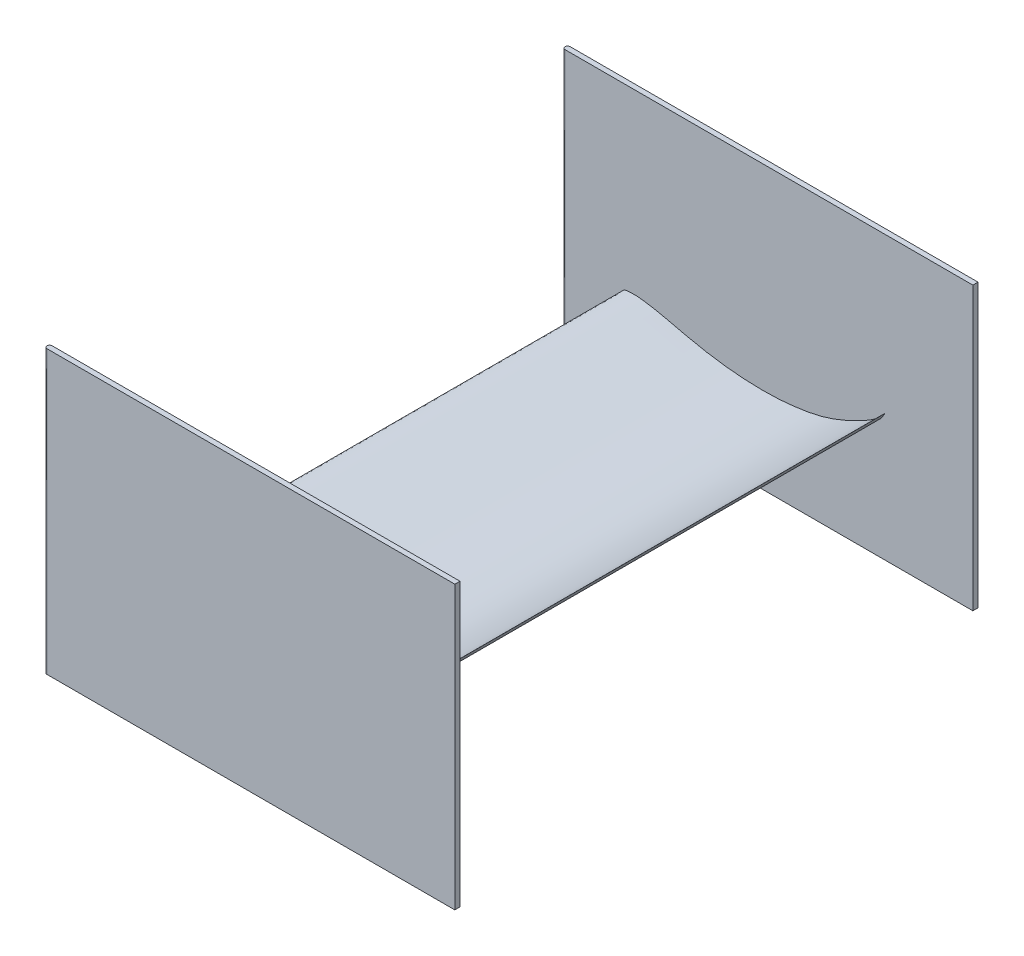
ISO-10303-21;
HEADER;
FILE_DESCRIPTION(('STEP AP214'),'2;1');
FILE_NAME('part.step','',(''),(''),'','','');
FILE_SCHEMA(('AUTOMOTIVE_DESIGN { 1 0 10303 214 1 1 1 1 }'));
ENDSEC;
DATA;
#1=APPLICATION_CONTEXT('core data for automotive mechanical design processes');
#2=APPLICATION_PROTOCOL_DEFINITION('international standard','automotive_design',2000,#1);
#3=PRODUCT_CONTEXT('',#1,'mechanical');
#4=PRODUCT('Part','Part','',(#3));
#5=PRODUCT_RELATED_PRODUCT_CATEGORY('part','',(#4));
#6=PRODUCT_DEFINITION_FORMATION('','',#4);
#7=PRODUCT_DEFINITION_CONTEXT('part definition',#1,'design');
#8=PRODUCT_DEFINITION('design','',#6,#7);
#9=PRODUCT_DEFINITION_SHAPE('','',#8);
#10=(LENGTH_UNIT() NAMED_UNIT(*) SI_UNIT(.MILLI.,.METRE.));
#11=(NAMED_UNIT(*) PLANE_ANGLE_UNIT() SI_UNIT($,.RADIAN.));
#12=(NAMED_UNIT(*) SI_UNIT($,.STERADIAN.) SOLID_ANGLE_UNIT());
#13=UNCERTAINTY_MEASURE_WITH_UNIT(LENGTH_MEASURE(1.E-05),#10,'distance_accuracy_value','');
#14=(GEOMETRIC_REPRESENTATION_CONTEXT(3) GLOBAL_UNCERTAINTY_ASSIGNED_CONTEXT((#13)) GLOBAL_UNIT_ASSIGNED_CONTEXT((#10,
#11,#12)) REPRESENTATION_CONTEXT('',''));
#15=CARTESIAN_POINT('',(0.,0.,0.));
#16=DIRECTION('',(0.,0.,1.));
#17=DIRECTION('',(1.,0.,0.));
#18=AXIS2_PLACEMENT_3D('',#15,#16,#17);
#19=CARTESIAN_POINT('',(-125.,346.245296694016,1005.));
#20=DIRECTION('',(0.,-1.,0.));
#21=DIRECTION('',(1.,0.,0.));
#22=AXIS2_PLACEMENT_3D('',#19,#20,#21);
#23=CYLINDRICAL_SURFACE('',#22,4.99999999999995);
#24=DIRECTION('',(0.,1.,0.));
#25=VECTOR('',#24,1.);
#26=CARTESIAN_POINT('',(-125.,346.245296694016,1010.));
#27=LINE('',#26,#25);
#28=CARTESIAN_POINT('',(-125.,346.245296694016,1010.));
#29=VERTEX_POINT('',#28);
#30=CARTESIAN_POINT('',(-125.,-203.754703305984,1010.));
#31=VERTEX_POINT('',#30);
#32=EDGE_CURVE('E197',#29,#31,#27,.F.);
#33=ORIENTED_EDGE('',*,*,#32,.F.);
#34=CARTESIAN_POINT('',(-125.,346.245296694016,1005.));
#35=DIRECTION('',(0.,-1.,0.));
#36=DIRECTION('',(1.,0.,0.));
#37=AXIS2_PLACEMENT_3D('',#34,#35,#36);
#38=CIRCLE('',#37,4.99999999999995);
#39=CARTESIAN_POINT('',(-125.,346.245296694016,1000.));
#40=VERTEX_POINT('',#39);
#41=EDGE_CURVE('E43',#40,#29,#38,.F.);
#42=ORIENTED_EDGE('',*,*,#41,.F.);
#43=DIRECTION('',(0.,-1.,0.));
#44=VECTOR('',#43,1.);
#45=CARTESIAN_POINT('',(-125.,0.,1000.));
#46=LINE('',#45,#44);
#47=CARTESIAN_POINT('',(-125.,-203.754703305984,1000.));
#48=VERTEX_POINT('',#47);
#49=EDGE_CURVE('E200',#48,#40,#46,.F.);
#50=ORIENTED_EDGE('',*,*,#49,.F.);
#51=CARTESIAN_POINT('',(-125.,-203.754703305984,1005.));
#52=DIRECTION('',(0.,1.,0.));
#53=DIRECTION('',(-1.,0.,0.));
#54=AXIS2_PLACEMENT_3D('',#51,#52,#53);
#55=CIRCLE('',#54,4.99999999999995);
#56=EDGE_CURVE('E11',#31,#48,#55,.F.);
#57=ORIENTED_EDGE('',*,*,#56,.F.);
#58=EDGE_LOOP('',(#33,#42,#50,#57));
#59=FACE_BOUND('',#58,.T.);
#60=ADVANCED_FACE('F35',(#59),#23,.T.);
#61=CARTESIAN_POINT('',(-125.,-203.754703305984,-5.));
#62=DIRECTION('',(0.,1.,0.));
#63=DIRECTION('',(-1.,0.,0.));
#64=AXIS2_PLACEMENT_3D('',#61,#62,#63);
#65=CYLINDRICAL_SURFACE('',#64,5.);
#66=DIRECTION('',(0.,-1.,0.));
#67=VECTOR('',#66,1.);
#68=CARTESIAN_POINT('',(-125.,-203.754703305984,-10.));
#69=LINE('',#68,#67);
#70=CARTESIAN_POINT('',(-125.,-203.754703305984,-10.));
#71=VERTEX_POINT('',#70);
#72=CARTESIAN_POINT('',(-125.,346.245296694016,-10.));
#73=VERTEX_POINT('',#72);
#74=EDGE_CURVE('E104',#71,#73,#69,.F.);
#75=ORIENTED_EDGE('',*,*,#74,.F.);
#76=CARTESIAN_POINT('',(-125.,-203.754703305984,-5.));
#77=DIRECTION('',(0.,1.,0.));
#78=DIRECTION('',(-1.,0.,0.));
#79=AXIS2_PLACEMENT_3D('',#76,#77,#78);
#80=CIRCLE('',#79,5.);
#81=CARTESIAN_POINT('',(-125.,-203.754703305984,0.));
#82=VERTEX_POINT('',#81);
#83=EDGE_CURVE('E179',#82,#71,#80,.F.);
#84=ORIENTED_EDGE('',*,*,#83,.F.);
#85=DIRECTION('',(0.,1.,0.));
#86=VECTOR('',#85,1.);
#87=CARTESIAN_POINT('',(-125.,0.,0.));
#88=LINE('',#87,#86);
#89=CARTESIAN_POINT('',(-125.,346.245296694016,0.));
#90=VERTEX_POINT('',#89);
#91=EDGE_CURVE('E182',#90,#82,#88,.F.);
#92=ORIENTED_EDGE('',*,*,#91,.F.);
#93=CARTESIAN_POINT('',(-125.,346.245296694016,-5.));
#94=DIRECTION('',(0.,-1.,0.));
#95=DIRECTION('',(1.,0.,0.));
#96=AXIS2_PLACEMENT_3D('',#93,#94,#95);
#97=CIRCLE('',#96,5.);
#98=EDGE_CURVE('E181',#73,#90,#97,.F.);
#99=ORIENTED_EDGE('',*,*,#98,.F.);
#100=EDGE_LOOP('',(#75,#84,#92,#99));
#101=FACE_BOUND('',#100,.T.);
#102=ADVANCED_FACE('F165',(#101),#65,.T.);
#103=CARTESIAN_POINT('',(0.,0.,1000.));
#104=CARTESIAN_POINT('',(-1.79238347056657,-0.150236033645887,1000.));
#105=CARTESIAN_POINT('',(-4.34020369518729,-0.456694264820047,1000.));
#106=CARTESIAN_POINT('',(-7.2926750108332,-1.02486808853701,1000.));
#107=CARTESIAN_POINT('',(-8.64440812950628,-1.31710364672282,1000.));
#108=CARTESIAN_POINT('',(-9.37359189698022,-1.56268113533759,1000.));
#109=CARTESIAN_POINT('',(-9.78131064716944,-1.74959750889733,1000.));
#110=CARTESIAN_POINT('',(-10.1190863473634,-1.95827277563385,1000.));
#111=CARTESIAN_POINT('',(-10.4036403498203,-2.19061022381483,1000.));
#112=CARTESIAN_POINT('',(-10.6746451761567,-2.4847012837307,1000.));
#113=CARTESIAN_POINT('',(-10.9649054490867,-2.90071585289435,1000.));
#114=CARTESIAN_POINT('',(-11.3182453819798,-3.58311025202582,1000.));
#115=CARTESIAN_POINT('',(-11.5875954146576,-4.31938160886983,1000.));
#116=CARTESIAN_POINT('',(-11.9035679537278,-5.36763163801123,1000.));
#117=CARTESIAN_POINT('',(-12.1585695831775,-6.58987971438526,1000.));
#118=CARTESIAN_POINT('',(-12.2821107843577,-8.22466264750741,1000.));
#119=CARTESIAN_POINT('',(-12.2116033337472,-9.72390131487863,1000.));
#120=CARTESIAN_POINT('',(-11.940939737408,-11.6784191243128,1000.));
#121=CARTESIAN_POINT('',(-11.2323819325218,-14.5097521804348,1000.));
#122=CARTESIAN_POINT('',(-9.90034332302243,-17.9160452605393,1000.));
#123=CARTESIAN_POINT('',(-8.13101624661956,-21.8915488549329,1000.));
#124=CARTESIAN_POINT('',(-6.02477649158455,-25.9392823072365,1000.));
#125=CARTESIAN_POINT('',(-3.11505271348353,-30.2932635347929,1000.));
#126=CARTESIAN_POINT('',(0.325855551287921,-34.5836875633221,1000.));
#127=CARTESIAN_POINT('',(4.42641704896127,-38.944393968076,1000.));
#128=CARTESIAN_POINT('',(9.21610477749053,-43.3454211497977,1000.));
#129=CARTESIAN_POINT('',(14.707220547895,-47.7028136132524,1000.));
#130=CARTESIAN_POINT('',(20.8552615472589,-51.9423948666041,1000.));
#131=CARTESIAN_POINT('',(27.692427856893,-56.0580175869247,1000.));
#132=CARTESIAN_POINT('',(35.2890643652679,-60.0738550324681,1000.));
#133=CARTESIAN_POINT('',(42.3278652985415,-63.337991332053,1000.));
#134=CARTESIAN_POINT('',(49.9472798093056,-66.4937436906336,1000.));
#135=CARTESIAN_POINT('',(58.0127717721022,-69.4453856102992,1000.));
#136=CARTESIAN_POINT('',(67.8780327049866,-72.4950054481098,1000.));
#137=CARTESIAN_POINT('',(78.1978761342595,-75.133552365577,1000.));
#138=CARTESIAN_POINT('',(88.9758822279052,-77.3461365547721,1000.));
#139=CARTESIAN_POINT('',(100.19088996534,-79.1103509406162,1000.));
#140=CARTESIAN_POINT('',(108.402453179714,-80.0325149482922,1000.));
#141=CARTESIAN_POINT('',(117.283673215021,-80.8396071645554,1000.));
#142=CARTESIAN_POINT('',(126.949150592404,-81.4904406521814,1000.));
#143=CARTESIAN_POINT('',(141.460321505899,-82.0053170163315,1000.));
#144=CARTESIAN_POINT('',(157.23293823616,-82.1464243672164,1000.));
#145=CARTESIAN_POINT('',(173.800828460242,-81.7486690923698,1000.));
#146=CARTESIAN_POINT('',(190.204921465137,-80.7703390664255,1000.));
#147=CARTESIAN_POINT('',(206.15848336432,-79.2303850304489,1000.));
#148=CARTESIAN_POINT('',(222.035478699966,-77.1553016176153,1000.));
#149=CARTESIAN_POINT('',(238.382512843873,-74.4806276456766,1000.));
#150=CARTESIAN_POINT('',(255.191070567964,-71.1831013472087,1000.));
#151=CARTESIAN_POINT('',(272.515570590789,-67.2395195080419,1000.));
#152=CARTESIAN_POINT('',(290.242380208517,-62.6726620042096,1000.));
#153=CARTESIAN_POINT('',(308.630742795253,-57.4057109184154,1000.));
#154=CARTESIAN_POINT('',(327.779739836183,-51.3889493398862,1000.));
#155=CARTESIAN_POINT('',(346.758308490816,-44.940673469396,1000.));
#156=CARTESIAN_POINT('',(364.92775817541,-38.2593883324821,1000.));
#157=CARTESIAN_POINT('',(382.2753718442,-31.3535876367837,1000.));
#158=CARTESIAN_POINT('',(399.149483536263,-24.0514227942054,1000.));
#159=CARTESIAN_POINT('',(415.744347167818,-16.22349153115,1000.));
#160=CARTESIAN_POINT('',(431.662293300436,-8.09134560947137,1000.));
#161=CARTESIAN_POINT('',(446.283581542364,-0.0111872306860348,1000.));
#162=CARTESIAN_POINT('',(459.05595566487,7.52875019964067,1000.));
#163=CARTESIAN_POINT('',(468.989646328941,13.8608504615123,1000.));
#164=CARTESIAN_POINT('',(476.43206863396,18.9577741655237,1000.));
#165=CARTESIAN_POINT('',(481.880186328602,23.039198956062,1000.));
#166=CARTESIAN_POINT('',(486.19335086321,26.7812480959819,1000.));
#167=CARTESIAN_POINT('',(489.900335437689,30.6041190367305,1000.));
#168=CARTESIAN_POINT('',(493.300932217132,35.0015670054303,1000.));
#169=CARTESIAN_POINT('',(495.628342666216,38.6357991636715,1000.));
#170=CARTESIAN_POINT('',(499.956506266224,46.4617234190221,1000.));
#171=CARTESIAN_POINT('',(492.711991295018,36.6381644269964,1000.));
#172=CARTESIAN_POINT('',(488.433461444835,32.8382140099348,1000.));
#173=CARTESIAN_POINT('',(482.50963687267,27.4275846999743,1000.));
#174=CARTESIAN_POINT('',(476.456898838001,22.8725644984591,1000.));
#175=CARTESIAN_POINT('',(469.733592842749,18.3715792568707,1000.));
#176=CARTESIAN_POINT('',(461.615330790641,13.5608424801748,1000.));
#177=CARTESIAN_POINT('',(449.853032102827,7.34216224748239,1000.));
#178=CARTESIAN_POINT('',(436.433188948317,0.692711913241849,1000.));
#179=CARTESIAN_POINT('',(422.565310012006,-5.91300529896626,1000.));
#180=CARTESIAN_POINT('',(410.590487812472,-11.0397775553372,1000.));
#181=CARTESIAN_POINT('',(398.59615275978,-15.6505278390814,1000.));
#182=CARTESIAN_POINT('',(386.462880922152,-19.724248180605,1000.));
#183=CARTESIAN_POINT('',(374.027877091718,-23.2996078907456,1000.));
#184=CARTESIAN_POINT('',(361.547073692603,-26.3033210148154,1000.));
#185=CARTESIAN_POINT('',(348.687179845197,-28.8327023172105,1000.));
#186=CARTESIAN_POINT('',(334.891604431017,-31.0647139061407,1000.));
#187=CARTESIAN_POINT('',(319.67449146938,-33.0985807811898,1000.));
#188=CARTESIAN_POINT('',(303.393301677396,-34.7505967544747,1000.));
#189=CARTESIAN_POINT('',(286.753621741545,-35.8678652521901,1000.));
#190=CARTESIAN_POINT('',(269.665193706734,-36.4146719788577,1000.));
#191=CARTESIAN_POINT('',(252.141046781379,-36.3845108264482,1000.));
#192=CARTESIAN_POINT('',(233.941914351152,-35.7862049869876,1000.));
#193=CARTESIAN_POINT('',(215.26781576462,-34.672978465114,1000.));
#194=CARTESIAN_POINT('',(196.275481587989,-33.0258644585831,1000.));
#195=CARTESIAN_POINT('',(177.427169683041,-30.8015551857533,1000.));
#196=CARTESIAN_POINT('',(159.113167716367,-28.0383489559626,1000.));
#197=CARTESIAN_POINT('',(140.589121825495,-24.7236509637244,1000.));
#198=CARTESIAN_POINT('',(120.893613893409,-20.7182837146455,1000.));
#199=CARTESIAN_POINT('',(99.4261633247432,-15.8799708159608,1000.));
#200=CARTESIAN_POINT('',(78.2796138826198,-10.8307239881243,1000.));
#201=CARTESIAN_POINT('',(59.4614816402526,-6.61605963210024,1000.));
#202=CARTESIAN_POINT('',(44.6037083470504,-3.69221832974815,1000.));
#203=CARTESIAN_POINT('',(32.6905609763722,-1.70484832729753,1000.));
#204=CARTESIAN_POINT('',(22.7208814088281,-0.451228548172747,1000.));
#205=CARTESIAN_POINT('',(14.0669890939576,0.216777748851585,1000.));
#206=CARTESIAN_POINT('',(6.63407451046139,0.365548011512216,1000.));
#207=CARTESIAN_POINT('',(2.0568354701323,0.172402171727882,1000.));
#208=CARTESIAN_POINT('',(0.,0.,1000.));
#209=B_SPLINE_CURVE_WITH_KNOTS('',3,(#103,#104,#105,#106,#107,#108,#109,#110,#111,#112,#113,
#114,#115,#116,#117,#118,#119,#120,#121,#122,#123,#124,#125,#126,#127,#128,#129,#130,#131,#132,
#133,#134,#135,#136,#137,#138,#139,#140,#141,#142,#143,#144,#145,#146,#147,#148,#149,#150,#151,
#152,#153,#154,#155,#156,#157,#158,#159,#160,#161,#162,#163,#164,#165,#166,#167,#168,#169,#170,
#171,#172,#173,#174,#175,#176,#177,#178,#179,#180,#181,#182,#183,#184,#185,#186,#187,#188,#189,
#190,#191,#192,#193,#194,#195,#196,#197,#198,#199,#200,#201,#202,#203,#204,#205,#206,#207,#208),
.UNSPECIFIED.,.T.,.F.,(4,1,1,1,1,1,1,1,1,1,1,1,1,1,1,1,1,1,1,1,1,1,1,1,1,1,1,1,1,1,1,1,1,1,1,1,
1,1,1,1,1,1,1,1,1,1,1,1,1,1,1,1,1,1,1,1,1,1,1,1,1,1,1,1,1,1,1,1,1,1,1,1,1,1,1,1,1,1,1,1,1,1,1,1,
1,1,1,1,1,1,1,1,1,1,1,1,1,1,1,1,1,1,1,4),(0.,0.00486498720637252,0.00693254524521891,
0.00813788435669305,0.00860149727128035,0.00901181840696386,0.00934865279773456,
0.0096731642835618,0.0100026596108538,0.0104275748205012,0.0110418174822611,0.0120766326629139,
0.0125434720315457,0.014004596260203,0.0154435818399652,0.0169687663105577,0.0180560683135106,
0.0207795247726854,0.0248406343782316,0.0279358855564014,0.0325554535440554,0.0371663626143194,
0.0420821080159116,0.0474218776089789,0.0533481896207324,0.0596674467011705,0.0663745655860388,
0.0735423368115471,0.0812490197247285,0.0896154033323993,0.0945263674953617,0.103562344523124,
0.112843807907009,0.122455999221578,0.132373756408963,0.14260534815104,0.153165587614205,
0.154726060672372,0.166736316983418,0.179371763289159,0.194012659114079,0.209411026755962,
0.224206692179842,0.238469752089365,0.252771690585992,0.267526239366753,0.283284172444976,
0.299113578757103,0.315597400733655,0.332811402570589,0.350865810671034,0.369905470866038,
0.387043715821497,0.403243824516595,0.420423249014811,0.436786871378303,0.452885030332324,
0.468782715546349,0.48198343638645,0.49301168675148,0.500654808832816,0.506381799232014,
0.511437541320662,0.516043966627856,0.520925913945336,0.525830531207915,0.529953558671425,
0.536609682497579,0.543291188228846,0.550106034163821,0.557026954660342,0.564113346016075,
0.571894396282258,0.58258008266935,0.600094179547477,0.61242484092006,0.624138462179078,
0.635332149629944,0.64718748312066,0.6587592246628,0.670332543322906,0.681912601165571,
0.694215176194797,0.708142392645253,0.723449251782781,0.73848835212507,0.753260173450307,
0.769704083265492,0.785898215648005,0.802525572661821,0.820318822274027,0.837475337311733,
0.853872349782661,0.870428328602395,0.888390885544636,0.908253004939095,0.929971273954701,
0.947220557189022,0.960430627996534,0.970941391538835,0.979895840022844,0.987611288807097,
0.99441722242359,1.),.UNSPECIFIED.);
#210=DIRECTION('',(0.,0.,-1.));
#211=VECTOR('',#210,1.);
#212=SURFACE_OF_LINEAR_EXTRUSION('',#209,#211);
#213=CARTESIAN_POINT('',(0.,0.,1000.));
#214=VERTEX_POINT('',#213);
#215=EDGE_CURVE('E149',#214,#214,#209,.T.);
#216=ORIENTED_EDGE('',*,*,#215,.F.);
#217=EDGE_LOOP('',(#216));
#218=FACE_BOUND('',#217,.T.);
#219=CARTESIAN_POINT('',(0.,0.,0.));
#220=CARTESIAN_POINT('',(-1.79238347056657,-0.150236033645887,0.));
#221=CARTESIAN_POINT('',(-4.34020369518729,-0.456694264820047,0.));
#222=CARTESIAN_POINT('',(-7.2926750108332,-1.02486808853701,0.));
#223=CARTESIAN_POINT('',(-8.64440812950628,-1.31710364672282,0.));
#224=CARTESIAN_POINT('',(-9.37359189698022,-1.56268113533759,0.));
#225=CARTESIAN_POINT('',(-9.78131064716944,-1.74959750889733,0.));
#226=CARTESIAN_POINT('',(-10.1190863473634,-1.95827277563385,0.));
#227=CARTESIAN_POINT('',(-10.4036403498203,-2.19061022381483,0.));
#228=CARTESIAN_POINT('',(-10.6746451761567,-2.4847012837307,0.));
#229=CARTESIAN_POINT('',(-10.9649054490867,-2.90071585289435,0.));
#230=CARTESIAN_POINT('',(-11.3182453819798,-3.58311025202582,0.));
#231=CARTESIAN_POINT('',(-11.5875954146576,-4.31938160886983,0.));
#232=CARTESIAN_POINT('',(-11.9035679537278,-5.36763163801123,0.));
#233=CARTESIAN_POINT('',(-12.1585695831775,-6.58987971438526,0.));
#234=CARTESIAN_POINT('',(-12.2821107843577,-8.22466264750741,0.));
#235=CARTESIAN_POINT('',(-12.2116033337472,-9.72390131487863,0.));
#236=CARTESIAN_POINT('',(-11.940939737408,-11.6784191243128,0.));
#237=CARTESIAN_POINT('',(-11.2323819325218,-14.5097521804348,0.));
#238=CARTESIAN_POINT('',(-9.90034332302243,-17.9160452605393,0.));
#239=CARTESIAN_POINT('',(-8.13101624661956,-21.8915488549329,0.));
#240=CARTESIAN_POINT('',(-6.02477649158455,-25.9392823072365,0.));
#241=CARTESIAN_POINT('',(-3.11505271348353,-30.2932635347929,0.));
#242=CARTESIAN_POINT('',(0.325855551287921,-34.5836875633221,0.));
#243=CARTESIAN_POINT('',(4.42641704896127,-38.944393968076,0.));
#244=CARTESIAN_POINT('',(9.21610477749053,-43.3454211497977,0.));
#245=CARTESIAN_POINT('',(14.707220547895,-47.7028136132524,0.));
#246=CARTESIAN_POINT('',(20.8552615472589,-51.9423948666041,0.));
#247=CARTESIAN_POINT('',(27.692427856893,-56.0580175869247,0.));
#248=CARTESIAN_POINT('',(35.2890643652679,-60.0738550324681,0.));
#249=CARTESIAN_POINT('',(42.3278652985415,-63.337991332053,0.));
#250=CARTESIAN_POINT('',(49.9472798093056,-66.4937436906336,0.));
#251=CARTESIAN_POINT('',(58.0127717721022,-69.4453856102992,0.));
#252=CARTESIAN_POINT('',(67.8780327049866,-72.4950054481098,0.));
#253=CARTESIAN_POINT('',(78.1978761342595,-75.133552365577,0.));
#254=CARTESIAN_POINT('',(88.9758822279052,-77.3461365547721,0.));
#255=CARTESIAN_POINT('',(100.19088996534,-79.1103509406162,0.));
#256=CARTESIAN_POINT('',(108.402453179714,-80.0325149482922,0.));
#257=CARTESIAN_POINT('',(117.283673215021,-80.8396071645554,0.));
#258=CARTESIAN_POINT('',(126.949150592404,-81.4904406521814,0.));
#259=CARTESIAN_POINT('',(141.460321505899,-82.0053170163315,0.));
#260=CARTESIAN_POINT('',(157.23293823616,-82.1464243672164,0.));
#261=CARTESIAN_POINT('',(173.800828460242,-81.7486690923698,0.));
#262=CARTESIAN_POINT('',(190.204921465137,-80.7703390664255,0.));
#263=CARTESIAN_POINT('',(206.15848336432,-79.2303850304489,0.));
#264=CARTESIAN_POINT('',(222.035478699966,-77.1553016176153,0.));
#265=CARTESIAN_POINT('',(238.382512843873,-74.4806276456766,0.));
#266=CARTESIAN_POINT('',(255.191070567964,-71.1831013472087,0.));
#267=CARTESIAN_POINT('',(272.515570590789,-67.2395195080419,0.));
#268=CARTESIAN_POINT('',(290.242380208517,-62.6726620042096,0.));
#269=CARTESIAN_POINT('',(308.630742795253,-57.4057109184154,0.));
#270=CARTESIAN_POINT('',(327.779739836183,-51.3889493398862,0.));
#271=CARTESIAN_POINT('',(346.758308490816,-44.940673469396,0.));
#272=CARTESIAN_POINT('',(364.92775817541,-38.2593883324821,0.));
#273=CARTESIAN_POINT('',(382.2753718442,-31.3535876367837,0.));
#274=CARTESIAN_POINT('',(399.149483536263,-24.0514227942054,0.));
#275=CARTESIAN_POINT('',(415.744347167818,-16.22349153115,0.));
#276=CARTESIAN_POINT('',(431.662293300436,-8.09134560947137,0.));
#277=CARTESIAN_POINT('',(446.283581542364,-0.0111872306860348,0.));
#278=CARTESIAN_POINT('',(459.05595566487,7.52875019964067,0.));
#279=CARTESIAN_POINT('',(468.989646328941,13.8608504615123,0.));
#280=CARTESIAN_POINT('',(476.43206863396,18.9577741655237,0.));
#281=CARTESIAN_POINT('',(481.880186328602,23.039198956062,0.));
#282=CARTESIAN_POINT('',(486.19335086321,26.7812480959819,0.));
#283=CARTESIAN_POINT('',(489.900335437689,30.6041190367305,0.));
#284=CARTESIAN_POINT('',(493.300932217132,35.0015670054303,0.));
#285=CARTESIAN_POINT('',(495.628342666216,38.6357991636715,0.));
#286=CARTESIAN_POINT('',(499.956506266224,46.4617234190221,0.));
#287=CARTESIAN_POINT('',(492.711991295018,36.6381644269964,0.));
#288=CARTESIAN_POINT('',(488.433461444835,32.8382140099348,0.));
#289=CARTESIAN_POINT('',(482.50963687267,27.4275846999743,0.));
#290=CARTESIAN_POINT('',(476.456898838001,22.8725644984591,0.));
#291=CARTESIAN_POINT('',(469.733592842749,18.3715792568707,0.));
#292=CARTESIAN_POINT('',(461.615330790641,13.5608424801748,0.));
#293=CARTESIAN_POINT('',(449.853032102827,7.34216224748239,0.));
#294=CARTESIAN_POINT('',(436.433188948317,0.692711913241849,0.));
#295=CARTESIAN_POINT('',(422.565310012006,-5.91300529896626,0.));
#296=CARTESIAN_POINT('',(410.590487812472,-11.0397775553372,0.));
#297=CARTESIAN_POINT('',(398.59615275978,-15.6505278390814,0.));
#298=CARTESIAN_POINT('',(386.462880922152,-19.724248180605,0.));
#299=CARTESIAN_POINT('',(374.027877091718,-23.2996078907456,0.));
#300=CARTESIAN_POINT('',(361.547073692603,-26.3033210148154,0.));
#301=CARTESIAN_POINT('',(348.687179845197,-28.8327023172105,0.));
#302=CARTESIAN_POINT('',(334.891604431017,-31.0647139061407,0.));
#303=CARTESIAN_POINT('',(319.67449146938,-33.0985807811898,0.));
#304=CARTESIAN_POINT('',(303.393301677396,-34.7505967544747,0.));
#305=CARTESIAN_POINT('',(286.753621741545,-35.8678652521901,0.));
#306=CARTESIAN_POINT('',(269.665193706734,-36.4146719788577,0.));
#307=CARTESIAN_POINT('',(252.141046781379,-36.3845108264482,0.));
#308=CARTESIAN_POINT('',(233.941914351152,-35.7862049869876,0.));
#309=CARTESIAN_POINT('',(215.26781576462,-34.672978465114,0.));
#310=CARTESIAN_POINT('',(196.275481587989,-33.0258644585831,0.));
#311=CARTESIAN_POINT('',(177.427169683041,-30.8015551857533,0.));
#312=CARTESIAN_POINT('',(159.113167716367,-28.0383489559626,0.));
#313=CARTESIAN_POINT('',(140.589121825495,-24.7236509637244,0.));
#314=CARTESIAN_POINT('',(120.893613893409,-20.7182837146455,0.));
#315=CARTESIAN_POINT('',(99.4261633247432,-15.8799708159608,0.));
#316=CARTESIAN_POINT('',(78.2796138826198,-10.8307239881243,0.));
#317=CARTESIAN_POINT('',(59.4614816402526,-6.61605963210024,0.));
#318=CARTESIAN_POINT('',(44.6037083470504,-3.69221832974815,0.));
#319=CARTESIAN_POINT('',(32.6905609763722,-1.70484832729753,0.));
#320=CARTESIAN_POINT('',(22.7208814088281,-0.451228548172747,0.));
#321=CARTESIAN_POINT('',(14.0669890939576,0.216777748851585,0.));
#322=CARTESIAN_POINT('',(6.63407451046139,0.365548011512216,0.));
#323=CARTESIAN_POINT('',(2.0568354701323,0.172402171727882,0.));
#324=CARTESIAN_POINT('',(0.,0.,0.));
#325=B_SPLINE_CURVE_WITH_KNOTS('',3,(#219,#220,#221,#222,#223,#224,#225,#226,#227,#228,#229,
#230,#231,#232,#233,#234,#235,#236,#237,#238,#239,#240,#241,#242,#243,#244,#245,#246,#247,#248,
#249,#250,#251,#252,#253,#254,#255,#256,#257,#258,#259,#260,#261,#262,#263,#264,#265,#266,#267,
#268,#269,#270,#271,#272,#273,#274,#275,#276,#277,#278,#279,#280,#281,#282,#283,#284,#285,#286,
#287,#288,#289,#290,#291,#292,#293,#294,#295,#296,#297,#298,#299,#300,#301,#302,#303,#304,#305,
#306,#307,#308,#309,#310,#311,#312,#313,#314,#315,#316,#317,#318,#319,#320,#321,#322,#323,#324),
.UNSPECIFIED.,.T.,.F.,(4,1,1,1,1,1,1,1,1,1,1,1,1,1,1,1,1,1,1,1,1,1,1,1,1,1,1,1,1,1,1,1,1,1,1,1,
1,1,1,1,1,1,1,1,1,1,1,1,1,1,1,1,1,1,1,1,1,1,1,1,1,1,1,1,1,1,1,1,1,1,1,1,1,1,1,1,1,1,1,1,1,1,1,1,
1,1,1,1,1,1,1,1,1,1,1,1,1,1,1,1,1,1,1,4),(0.,0.00486498720637252,0.00693254524521891,
0.00813788435669305,0.00860149727128035,0.00901181840696386,0.00934865279773456,
0.0096731642835618,0.0100026596108538,0.0104275748205012,0.0110418174822611,0.0120766326629139,
0.0125434720315457,0.014004596260203,0.0154435818399652,0.0169687663105577,0.0180560683135106,
0.0207795247726854,0.0248406343782316,0.0279358855564014,0.0325554535440554,0.0371663626143194,
0.0420821080159116,0.0474218776089789,0.0533481896207324,0.0596674467011705,0.0663745655860388,
0.0735423368115471,0.0812490197247285,0.0896154033323993,0.0945263674953617,0.103562344523124,
0.112843807907009,0.122455999221578,0.132373756408963,0.14260534815104,0.153165587614205,
0.154726060672372,0.166736316983418,0.179371763289159,0.194012659114079,0.209411026755962,
0.224206692179842,0.238469752089365,0.252771690585992,0.267526239366753,0.283284172444976,
0.299113578757103,0.315597400733655,0.332811402570589,0.350865810671034,0.369905470866038,
0.387043715821497,0.403243824516595,0.420423249014811,0.436786871378303,0.452885030332324,
0.468782715546349,0.48198343638645,0.49301168675148,0.500654808832816,0.506381799232014,
0.511437541320662,0.516043966627856,0.520925913945336,0.525830531207915,0.529953558671425,
0.536609682497579,0.543291188228846,0.550106034163821,0.557026954660342,0.564113346016075,
0.571894396282258,0.58258008266935,0.600094179547477,0.61242484092006,0.624138462179078,
0.635332149629944,0.64718748312066,0.6587592246628,0.670332543322906,0.681912601165571,
0.694215176194797,0.708142392645253,0.723449251782781,0.73848835212507,0.753260173450307,
0.769704083265492,0.785898215648005,0.802525572661821,0.820318822274027,0.837475337311733,
0.853872349782661,0.870428328602395,0.888390885544636,0.908253004939095,0.929971273954701,
0.947220557189022,0.960430627996534,0.970941391538835,0.979895840022844,0.987611288807097,
0.99441722242359,1.),.UNSPECIFIED.);
#326=CARTESIAN_POINT('',(0.,0.,0.));
#327=VERTEX_POINT('',#326);
#328=EDGE_CURVE('E122',#327,#327,#325,.T.);
#329=ORIENTED_EDGE('',*,*,#328,.T.);
#330=EDGE_LOOP('',(#329));
#331=FACE_BOUND('',#330,.T.);
#332=ADVANCED_FACE('F161',(#218,#331),#212,.F.);
#333=CARTESIAN_POINT('',(0.,0.,1000.));
#334=DIRECTION('',(0.,0.,1.));
#335=DIRECTION('',(1.,0.,0.));
#336=AXIS2_PLACEMENT_3D('',#333,#334,#335);
#337=PLANE('',#336);
#338=DIRECTION('',(1.,0.,0.));
#339=VECTOR('',#338,1.);
#340=CARTESIAN_POINT('',(670.,-203.754703305984,1000.));
#341=LINE('',#340,#339);
#342=CARTESIAN_POINT('',(670.,-203.754703305984,1000.));
#343=VERTEX_POINT('',#342);
#344=EDGE_CURVE('E125',#48,#343,#341,.T.);
#345=ORIENTED_EDGE('',*,*,#344,.F.);
#346=ORIENTED_EDGE('',*,*,#49,.T.);
#347=DIRECTION('',(-1.,0.,0.));
#348=VECTOR('',#347,1.);
#349=CARTESIAN_POINT('',(670.,346.245296694016,1000.));
#350=LINE('',#349,#348);
#351=CARTESIAN_POINT('',(670.,346.245296694016,1000.));
#352=VERTEX_POINT('',#351);
#353=EDGE_CURVE('E133',#352,#40,#350,.T.);
#354=ORIENTED_EDGE('',*,*,#353,.F.);
#355=DIRECTION('',(0.,1.,0.));
#356=VECTOR('',#355,1.);
#357=CARTESIAN_POINT('',(670.,-203.754703305984,1000.));
#358=LINE('',#357,#356);
#359=EDGE_CURVE('E140',#343,#352,#358,.T.);
#360=ORIENTED_EDGE('',*,*,#359,.F.);
#361=EDGE_LOOP('',(#345,#346,#354,#360));
#362=FACE_BOUND('',#361,.T.);
#363=ORIENTED_EDGE('',*,*,#215,.T.);
#364=EDGE_LOOP('',(#363));
#365=FACE_BOUND('',#364,.T.);
#366=ADVANCED_FACE('F164',(#362,#365),#337,.F.);
#367=CARTESIAN_POINT('',(670.,-203.754703305984,1010.));
#368=DIRECTION('',(0.,1.,0.));
#369=DIRECTION('',(-1.,0.,0.));
#370=AXIS2_PLACEMENT_3D('',#367,#368,#369);
#371=PLANE('',#370);
#372=DIRECTION('',(1.,0.,0.));
#373=VECTOR('',#372,1.);
#374=CARTESIAN_POINT('',(670.,-203.754703305984,1010.));
#375=LINE('',#374,#373);
#376=CARTESIAN_POINT('',(670.,-203.754703305984,1010.));
#377=VERTEX_POINT('',#376);
#378=EDGE_CURVE('E130',#31,#377,#375,.T.);
#379=ORIENTED_EDGE('',*,*,#378,.F.);
#380=ORIENTED_EDGE('',*,*,#56,.T.);
#381=ORIENTED_EDGE('',*,*,#344,.T.);
#382=DIRECTION('',(0.,0.,-1.));
#383=VECTOR('',#382,1.);
#384=CARTESIAN_POINT('',(670.,-203.754703305984,1010.));
#385=LINE('',#384,#383);
#386=EDGE_CURVE('E146',#377,#343,#385,.T.);
#387=ORIENTED_EDGE('',*,*,#386,.F.);
#388=EDGE_LOOP('',(#379,#380,#381,#387));
#389=FACE_BOUND('',#388,.T.);
#390=ADVANCED_FACE('F167',(#389),#371,.F.);
#391=CARTESIAN_POINT('',(670.,-203.754703305984,1010.));
#392=DIRECTION('',(-1.,0.,0.));
#393=DIRECTION('',(0.,0.,1.));
#394=AXIS2_PLACEMENT_3D('',#391,#392,#393);
#395=PLANE('',#394);
#396=ORIENTED_EDGE('',*,*,#359,.T.);
#397=DIRECTION('',(0.,0.,-1.));
#398=VECTOR('',#397,1.);
#399=CARTESIAN_POINT('',(670.,346.245296694016,1010.));
#400=LINE('',#399,#398);
#401=CARTESIAN_POINT('',(670.,346.245296694016,1010.));
#402=VERTEX_POINT('',#401);
#403=EDGE_CURVE('E138',#402,#352,#400,.T.);
#404=ORIENTED_EDGE('',*,*,#403,.F.);
#405=DIRECTION('',(0.,1.,0.));
#406=VECTOR('',#405,1.);
#407=CARTESIAN_POINT('',(670.,-203.754703305984,1010.));
#408=LINE('',#407,#406);
#409=EDGE_CURVE('E132',#377,#402,#408,.T.);
#410=ORIENTED_EDGE('',*,*,#409,.F.);
#411=ORIENTED_EDGE('',*,*,#386,.T.);
#412=EDGE_LOOP('',(#396,#404,#410,#411));
#413=FACE_BOUND('',#412,.T.);
#414=ADVANCED_FACE('F211',(#413),#395,.F.);
#415=CARTESIAN_POINT('',(670.,346.245296694016,1010.));
#416=DIRECTION('',(0.,-1.,0.));
#417=DIRECTION('',(1.,0.,0.));
#418=AXIS2_PLACEMENT_3D('',#415,#416,#417);
#419=PLANE('',#418);
#420=ORIENTED_EDGE('',*,*,#353,.T.);
#421=ORIENTED_EDGE('',*,*,#41,.T.);
#422=DIRECTION('',(-1.,0.,0.));
#423=VECTOR('',#422,1.);
#424=CARTESIAN_POINT('',(670.,346.245296694016,1010.));
#425=LINE('',#424,#423);
#426=EDGE_CURVE('E135',#402,#29,#425,.T.);
#427=ORIENTED_EDGE('',*,*,#426,.F.);
#428=ORIENTED_EDGE('',*,*,#403,.T.);
#429=EDGE_LOOP('',(#420,#421,#427,#428));
#430=FACE_BOUND('',#429,.T.);
#431=ADVANCED_FACE('F203',(#430),#419,.F.);
#432=CARTESIAN_POINT('',(0.,0.,1010.));
#433=DIRECTION('',(0.,0.,1.));
#434=DIRECTION('',(1.,0.,0.));
#435=AXIS2_PLACEMENT_3D('',#432,#433,#434);
#436=PLANE('',#435);
#437=ORIENTED_EDGE('',*,*,#426,.T.);
#438=ORIENTED_EDGE('',*,*,#32,.T.);
#439=ORIENTED_EDGE('',*,*,#378,.T.);
#440=ORIENTED_EDGE('',*,*,#409,.T.);
#441=EDGE_LOOP('',(#437,#438,#439,#440));
#442=FACE_BOUND('',#441,.T.);
#443=ADVANCED_FACE('F206',(#442),#436,.T.);
#444=CARTESIAN_POINT('',(-130.,346.245296694016,-10.));
#445=DIRECTION('',(0.,-1.,0.));
#446=DIRECTION('',(1.,0.,0.));
#447=AXIS2_PLACEMENT_3D('',#444,#445,#446);
#448=PLANE('',#447);
#449=DIRECTION('',(1.,0.,0.));
#450=VECTOR('',#449,1.);
#451=CARTESIAN_POINT('',(-130.,346.245296694016,-10.));
#452=LINE('',#451,#450);
#453=CARTESIAN_POINT('',(670.,346.245296694016,-10.));
#454=VERTEX_POINT('',#453);
#455=EDGE_CURVE('E97',#73,#454,#452,.T.);
#456=ORIENTED_EDGE('',*,*,#455,.F.);
#457=ORIENTED_EDGE('',*,*,#98,.T.);
#458=DIRECTION('',(1.,0.,0.));
#459=VECTOR('',#458,1.);
#460=CARTESIAN_POINT('',(-130.,346.245296694016,0.));
#461=LINE('',#460,#459);
#462=CARTESIAN_POINT('',(670.,346.245296694016,0.));
#463=VERTEX_POINT('',#462);
#464=EDGE_CURVE('E120',#90,#463,#461,.T.);
#465=ORIENTED_EDGE('',*,*,#464,.T.);
#466=DIRECTION('',(0.,0.,1.));
#467=VECTOR('',#466,1.);
#468=CARTESIAN_POINT('',(670.,346.245296694016,-10.));
#469=LINE('',#468,#467);
#470=EDGE_CURVE('E112',#454,#463,#469,.T.);
#471=ORIENTED_EDGE('',*,*,#470,.F.);
#472=EDGE_LOOP('',(#456,#457,#465,#471));
#473=FACE_BOUND('',#472,.T.);
#474=ADVANCED_FACE('F118',(#473),#448,.F.);
#475=CARTESIAN_POINT('',(670.,346.245296694016,-10.));
#476=DIRECTION('',(-1.,0.,0.));
#477=DIRECTION('',(0.,0.,1.));
#478=AXIS2_PLACEMENT_3D('',#475,#476,#477);
#479=PLANE('',#478);
#480=DIRECTION('',(0.,-1.,0.));
#481=VECTOR('',#480,1.);
#482=CARTESIAN_POINT('',(670.,346.245296694016,0.));
#483=LINE('',#482,#481);
#484=CARTESIAN_POINT('',(670.,-203.754703305984,0.));
#485=VERTEX_POINT('',#484);
#486=EDGE_CURVE('E187',#463,#485,#483,.T.);
#487=ORIENTED_EDGE('',*,*,#486,.T.);
#488=DIRECTION('',(0.,0.,1.));
#489=VECTOR('',#488,1.);
#490=CARTESIAN_POINT('',(670.,-203.754703305984,-10.));
#491=LINE('',#490,#489);
#492=CARTESIAN_POINT('',(670.,-203.754703305984,-10.));
#493=VERTEX_POINT('',#492);
#494=EDGE_CURVE('E114',#493,#485,#491,.T.);
#495=ORIENTED_EDGE('',*,*,#494,.F.);
#496=DIRECTION('',(0.,-1.,0.));
#497=VECTOR('',#496,1.);
#498=CARTESIAN_POINT('',(670.,346.245296694016,-10.));
#499=LINE('',#498,#497);
#500=EDGE_CURVE('E101',#454,#493,#499,.T.);
#501=ORIENTED_EDGE('',*,*,#500,.F.);
#502=ORIENTED_EDGE('',*,*,#470,.T.);
#503=EDGE_LOOP('',(#487,#495,#501,#502));
#504=FACE_BOUND('',#503,.T.);
#505=ADVANCED_FACE('F111',(#504),#479,.F.);
#506=CARTESIAN_POINT('',(670.,-203.754703305984,-10.));
#507=DIRECTION('',(0.,1.,0.));
#508=DIRECTION('',(-1.,0.,0.));
#509=AXIS2_PLACEMENT_3D('',#506,#507,#508);
#510=PLANE('',#509);
#511=DIRECTION('',(-1.,0.,0.));
#512=VECTOR('',#511,1.);
#513=CARTESIAN_POINT('',(670.,-203.754703305984,0.));
#514=LINE('',#513,#512);
#515=EDGE_CURVE('E107',#485,#82,#514,.T.);
#516=ORIENTED_EDGE('',*,*,#515,.T.);
#517=ORIENTED_EDGE('',*,*,#83,.T.);
#518=DIRECTION('',(-1.,0.,0.));
#519=VECTOR('',#518,1.);
#520=CARTESIAN_POINT('',(670.,-203.754703305984,-10.));
#521=LINE('',#520,#519);
#522=EDGE_CURVE('E116',#493,#71,#521,.T.);
#523=ORIENTED_EDGE('',*,*,#522,.F.);
#524=ORIENTED_EDGE('',*,*,#494,.T.);
#525=EDGE_LOOP('',(#516,#517,#523,#524));
#526=FACE_BOUND('',#525,.T.);
#527=ADVANCED_FACE('F190',(#526),#510,.F.);
#528=CARTESIAN_POINT('',(0.,0.,-10.));
#529=DIRECTION('',(0.,0.,-1.));
#530=DIRECTION('',(-1.,0.,0.));
#531=AXIS2_PLACEMENT_3D('',#528,#529,#530);
#532=PLANE('',#531);
#533=ORIENTED_EDGE('',*,*,#522,.T.);
#534=ORIENTED_EDGE('',*,*,#74,.T.);
#535=ORIENTED_EDGE('',*,*,#455,.T.);
#536=ORIENTED_EDGE('',*,*,#500,.T.);
#537=EDGE_LOOP('',(#533,#534,#535,#536));
#538=FACE_BOUND('',#537,.T.);
#539=ADVANCED_FACE('F100',(#538),#532,.T.);
#540=CARTESIAN_POINT('',(0.,0.,0.));
#541=DIRECTION('',(0.,0.,-1.));
#542=DIRECTION('',(-1.,0.,0.));
#543=AXIS2_PLACEMENT_3D('',#540,#541,#542);
#544=PLANE('',#543);
#545=ORIENTED_EDGE('',*,*,#328,.F.);
#546=EDGE_LOOP('',(#545));
#547=FACE_BOUND('',#546,.T.);
#548=ORIENTED_EDGE('',*,*,#464,.F.);
#549=ORIENTED_EDGE('',*,*,#91,.T.);
#550=ORIENTED_EDGE('',*,*,#515,.F.);
#551=ORIENTED_EDGE('',*,*,#486,.F.);
#552=EDGE_LOOP('',(#548,#549,#550,#551));
#553=FACE_BOUND('',#552,.T.);
#554=ADVANCED_FACE('F192',(#547,#553),#544,.F.);
#555=CLOSED_SHELL('',(#60,#102,#332,#366,#390,#414,#431,#443,#474,#505,#527,#539,#554));
#556=MANIFOLD_SOLID_BREP('B2',#555);
#557=ADVANCED_BREP_SHAPE_REPRESENTATION('',(#18,#556),#14);
#558=SHAPE_DEFINITION_REPRESENTATION(#9,#557);
ENDSEC;
END-ISO-10303-21;
